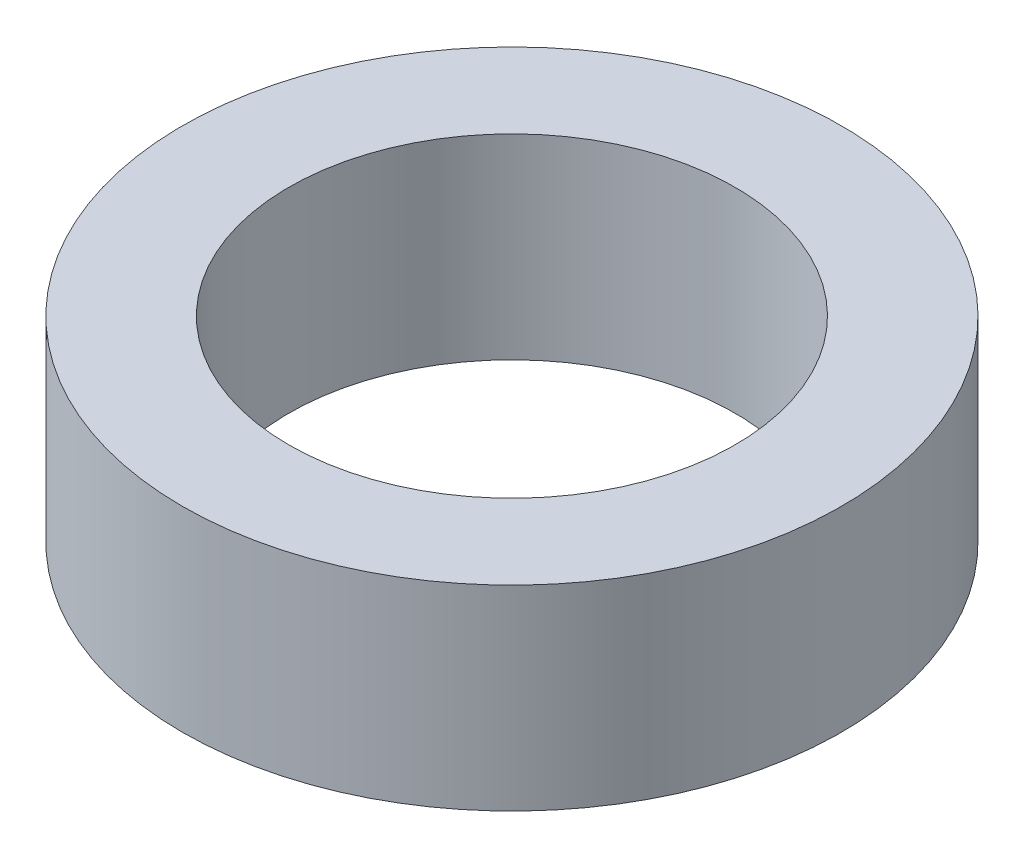
ISO-10303-21;
HEADER;
FILE_DESCRIPTION(('STEP AP214'),'2;1');
FILE_NAME('part.step','',(''),(''),'','','');
FILE_SCHEMA(('AUTOMOTIVE_DESIGN { 1 0 10303 214 1 1 1 1 }'));
ENDSEC;
DATA;
#1=APPLICATION_CONTEXT('core data for automotive mechanical design processes');
#2=APPLICATION_PROTOCOL_DEFINITION('international standard','automotive_design',2000,#1);
#3=PRODUCT_CONTEXT('',#1,'mechanical');
#4=PRODUCT('Part','Part','',(#3));
#5=PRODUCT_RELATED_PRODUCT_CATEGORY('part','',(#4));
#6=PRODUCT_DEFINITION_FORMATION('','',#4);
#7=PRODUCT_DEFINITION_CONTEXT('part definition',#1,'design');
#8=PRODUCT_DEFINITION('design','',#6,#7);
#9=PRODUCT_DEFINITION_SHAPE('','',#8);
#10=(LENGTH_UNIT() NAMED_UNIT(*) SI_UNIT(.MILLI.,.METRE.));
#11=(NAMED_UNIT(*) PLANE_ANGLE_UNIT() SI_UNIT($,.RADIAN.));
#12=(NAMED_UNIT(*) SI_UNIT($,.STERADIAN.) SOLID_ANGLE_UNIT());
#13=UNCERTAINTY_MEASURE_WITH_UNIT(LENGTH_MEASURE(1.E-05),#10,'distance_accuracy_value','');
#14=(GEOMETRIC_REPRESENTATION_CONTEXT(3) GLOBAL_UNCERTAINTY_ASSIGNED_CONTEXT((#13)) GLOBAL_UNIT_ASSIGNED_CONTEXT((#10,
#11,#12)) REPRESENTATION_CONTEXT('',''));
#15=CARTESIAN_POINT('',(0.,0.,0.));
#16=DIRECTION('',(0.,0.,1.));
#17=DIRECTION('',(1.,0.,0.));
#18=AXIS2_PLACEMENT_3D('',#15,#16,#17);
#19=CARTESIAN_POINT('',(0.,5.7,0.));
#20=DIRECTION('',(0.,1.,0.));
#21=DIRECTION('',(0.,0.,1.));
#22=AXIS2_PLACEMENT_3D('',#19,#20,#21);
#23=PLANE('',#22);
#24=CARTESIAN_POINT('',(0.,5.7,0.));
#25=DIRECTION('',(0.,1.,0.));
#26=DIRECTION('',(0.,0.,1.));
#27=AXIS2_PLACEMENT_3D('',#24,#25,#26);
#28=CIRCLE('',#27,9.6);
#29=CARTESIAN_POINT('',(0.,5.7,9.6));
#30=VERTEX_POINT('',#29);
#31=EDGE_CURVE('E10',#30,#30,#28,.T.);
#32=ORIENTED_EDGE('',*,*,#31,.T.);
#33=EDGE_LOOP('',(#32));
#34=FACE_BOUND('',#33,.T.);
#35=CARTESIAN_POINT('',(0.,5.7,0.));
#36=DIRECTION('',(0.,1.,0.));
#37=DIRECTION('',(0.,0.,1.));
#38=AXIS2_PLACEMENT_3D('',#35,#36,#37);
#39=CIRCLE('',#38,6.5);
#40=CARTESIAN_POINT('',(0.,5.7,6.5));
#41=VERTEX_POINT('',#40);
#42=EDGE_CURVE('E52',#41,#41,#39,.T.);
#43=ORIENTED_EDGE('',*,*,#42,.F.);
#44=EDGE_LOOP('',(#43));
#45=FACE_BOUND('',#44,.T.);
#46=ADVANCED_FACE('F39',(#34,#45),#23,.T.);
#47=CARTESIAN_POINT('',(0.,0.,0.));
#48=DIRECTION('',(0.,1.,0.));
#49=DIRECTION('',(0.,0.,1.));
#50=AXIS2_PLACEMENT_3D('',#47,#48,#49);
#51=PLANE('',#50);
#52=CARTESIAN_POINT('',(0.,0.,0.));
#53=DIRECTION('',(0.,1.,0.));
#54=DIRECTION('',(0.,0.,1.));
#55=AXIS2_PLACEMENT_3D('',#52,#53,#54);
#56=CIRCLE('',#55,9.6);
#57=CARTESIAN_POINT('',(0.,0.,9.6));
#58=VERTEX_POINT('',#57);
#59=EDGE_CURVE('E43',#58,#58,#56,.T.);
#60=ORIENTED_EDGE('',*,*,#59,.F.);
#61=EDGE_LOOP('',(#60));
#62=FACE_BOUND('',#61,.T.);
#63=CARTESIAN_POINT('',(0.,0.,0.));
#64=DIRECTION('',(0.,1.,0.));
#65=DIRECTION('',(0.,0.,1.));
#66=AXIS2_PLACEMENT_3D('',#63,#64,#65);
#67=CIRCLE('',#66,6.5);
#68=CARTESIAN_POINT('',(0.,0.,6.5));
#69=VERTEX_POINT('',#68);
#70=EDGE_CURVE('E54',#69,#69,#67,.T.);
#71=ORIENTED_EDGE('',*,*,#70,.T.);
#72=EDGE_LOOP('',(#71));
#73=FACE_BOUND('',#72,.T.);
#74=ADVANCED_FACE('F66',(#62,#73),#51,.F.);
#75=CARTESIAN_POINT('',(0.,5.7,0.));
#76=DIRECTION('',(0.,-1.,0.));
#77=DIRECTION('',(0.,0.,-1.));
#78=AXIS2_PLACEMENT_3D('',#75,#76,#77);
#79=CYLINDRICAL_SURFACE('',#78,9.6);
#80=ORIENTED_EDGE('',*,*,#31,.F.);
#81=EDGE_LOOP('',(#80));
#82=FACE_BOUND('',#81,.T.);
#83=ORIENTED_EDGE('',*,*,#59,.T.);
#84=EDGE_LOOP('',(#83));
#85=FACE_BOUND('',#84,.T.);
#86=ADVANCED_FACE('F41',(#82,#85),#79,.T.);
#87=CARTESIAN_POINT('',(0.,5.7,0.));
#88=DIRECTION('',(0.,-1.,0.));
#89=DIRECTION('',(0.,0.,-1.));
#90=AXIS2_PLACEMENT_3D('',#87,#88,#89);
#91=CYLINDRICAL_SURFACE('',#90,6.5);
#92=ORIENTED_EDGE('',*,*,#42,.T.);
#93=EDGE_LOOP('',(#92));
#94=FACE_BOUND('',#93,.T.);
#95=ORIENTED_EDGE('',*,*,#70,.F.);
#96=EDGE_LOOP('',(#95));
#97=FACE_BOUND('',#96,.T.);
#98=ADVANCED_FACE('F62',(#94,#97),#91,.F.);
#99=CLOSED_SHELL('',(#46,#74,#86,#98));
#100=MANIFOLD_SOLID_BREP('B2',#99);
#101=ADVANCED_BREP_SHAPE_REPRESENTATION('',(#18,#100),#14);
#102=SHAPE_DEFINITION_REPRESENTATION(#9,#101);
ENDSEC;
END-ISO-10303-21;
